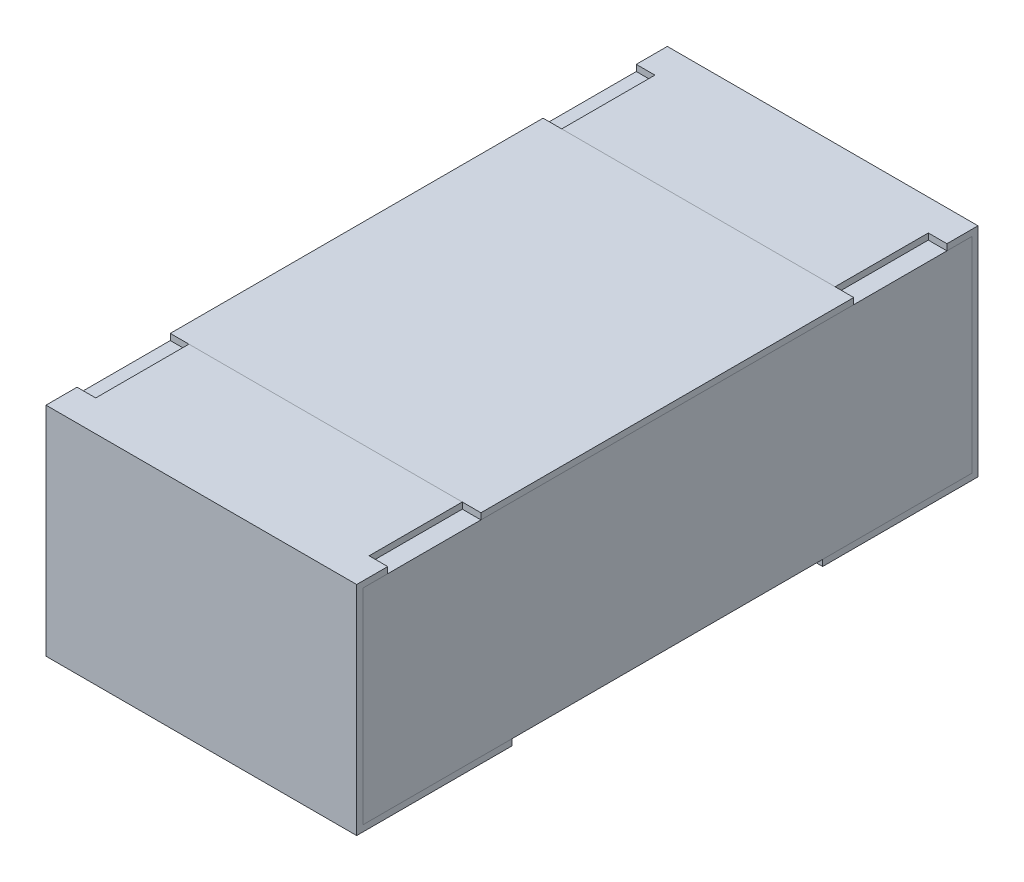
ISO-10303-21;
HEADER;
FILE_DESCRIPTION(('STEP AP214'),'2;1');
FILE_NAME('part.step','',(''),(''),'','','');
FILE_SCHEMA(('AUTOMOTIVE_DESIGN { 1 0 10303 214 1 1 1 1 }'));
ENDSEC;
DATA;
#1=APPLICATION_CONTEXT('core data for automotive mechanical design processes');
#2=APPLICATION_PROTOCOL_DEFINITION('international standard','automotive_design',2000,#1);
#3=PRODUCT_CONTEXT('',#1,'mechanical');
#4=PRODUCT('Part','Part','',(#3));
#5=PRODUCT_RELATED_PRODUCT_CATEGORY('part','',(#4));
#6=PRODUCT_DEFINITION_FORMATION('','',#4);
#7=PRODUCT_DEFINITION_CONTEXT('part definition',#1,'design');
#8=PRODUCT_DEFINITION('design','',#6,#7);
#9=PRODUCT_DEFINITION_SHAPE('','',#8);
#10=(LENGTH_UNIT() NAMED_UNIT(*) SI_UNIT(.MILLI.,.METRE.));
#11=(NAMED_UNIT(*) PLANE_ANGLE_UNIT() SI_UNIT($,.RADIAN.));
#12=(NAMED_UNIT(*) SI_UNIT($,.STERADIAN.) SOLID_ANGLE_UNIT());
#13=UNCERTAINTY_MEASURE_WITH_UNIT(LENGTH_MEASURE(1.E-05),#10,'distance_accuracy_value','');
#14=(GEOMETRIC_REPRESENTATION_CONTEXT(3) GLOBAL_UNCERTAINTY_ASSIGNED_CONTEXT((#13)) GLOBAL_UNIT_ASSIGNED_CONTEXT((#10,
#11,#12)) REPRESENTATION_CONTEXT('',''));
#15=CARTESIAN_POINT('',(0.,0.,0.));
#16=DIRECTION('',(0.,0.,1.));
#17=DIRECTION('',(1.,0.,0.));
#18=AXIS2_PLACEMENT_3D('',#15,#16,#17);
#19=CARTESIAN_POINT('',(-0.25,0.165,0.3));
#20=DIRECTION('',(0.,1.,0.));
#21=DIRECTION('',(0.,0.,1.));
#22=AXIS2_PLACEMENT_3D('',#19,#20,#21);
#23=PLANE('',#22);
#24=DIRECTION('',(0.,0.,1.));
#25=VECTOR('',#24,1.);
#26=CARTESIAN_POINT('',(-0.25,0.165,-0.3));
#27=LINE('',#26,#25);
#28=CARTESIAN_POINT('',(-0.25,0.165,-0.3));
#29=VERTEX_POINT('',#28);
#30=CARTESIAN_POINT('',(-0.25,0.165,0.3));
#31=VERTEX_POINT('',#30);
#32=EDGE_CURVE('E95',#29,#31,#27,.T.);
#33=ORIENTED_EDGE('',*,*,#32,.F.);
#34=DIRECTION('',(-1.,0.,0.));
#35=VECTOR('',#34,1.);
#36=CARTESIAN_POINT('',(-0.25,0.165,-0.3));
#37=LINE('',#36,#35);
#38=CARTESIAN_POINT('',(0.25,0.165,-0.3));
#39=VERTEX_POINT('',#38);
#40=EDGE_CURVE('E106',#39,#29,#37,.T.);
#41=ORIENTED_EDGE('',*,*,#40,.F.);
#42=DIRECTION('',(0.,0.,-1.));
#43=VECTOR('',#42,1.);
#44=CARTESIAN_POINT('',(0.25,0.165,-0.3));
#45=LINE('',#44,#43);
#46=CARTESIAN_POINT('',(0.250000000000001,0.165,0.3));
#47=VERTEX_POINT('',#46);
#48=EDGE_CURVE('E97',#47,#39,#45,.T.);
#49=ORIENTED_EDGE('',*,*,#48,.F.);
#50=DIRECTION('',(1.,0.,0.));
#51=VECTOR('',#50,1.);
#52=CARTESIAN_POINT('',(-0.25,0.165,0.3));
#53=LINE('',#52,#51);
#54=EDGE_CURVE('E87',#31,#47,#53,.T.);
#55=ORIENTED_EDGE('',*,*,#54,.F.);
#56=EDGE_LOOP('',(#33,#41,#49,#55));
#57=FACE_BOUND('',#56,.T.);
#58=ADVANCED_FACE('F45',(#57),#23,.F.);
#59=CARTESIAN_POINT('',(-0.25,0.956024967590666,-0.3));
#60=DIRECTION('',(0.,0.,1.));
#61=DIRECTION('',(1.,0.,0.));
#62=AXIS2_PLACEMENT_3D('',#59,#60,#61);
#63=PLANE('',#62);
#64=DIRECTION('',(0.,-1.,0.));
#65=VECTOR('',#64,1.);
#66=CARTESIAN_POINT('',(-0.25,0.956024967590666,-0.3));
#67=LINE('',#66,#65);
#68=CARTESIAN_POINT('',(-0.25,0.175,-0.3));
#69=VERTEX_POINT('',#68);
#70=EDGE_CURVE('E100',#69,#29,#67,.T.);
#71=ORIENTED_EDGE('',*,*,#70,.F.);
#72=DIRECTION('',(1.,0.,0.));
#73=VECTOR('',#72,1.);
#74=CARTESIAN_POINT('',(-0.25,0.175,-0.3));
#75=LINE('',#74,#73);
#76=CARTESIAN_POINT('',(0.25,0.175,-0.3));
#77=VERTEX_POINT('',#76);
#78=EDGE_CURVE('E49',#69,#77,#75,.T.);
#79=ORIENTED_EDGE('',*,*,#78,.T.);
#80=DIRECTION('',(0.,-1.,0.));
#81=VECTOR('',#80,1.);
#82=CARTESIAN_POINT('',(0.25,0.956024967590666,-0.3));
#83=LINE('',#82,#81);
#84=EDGE_CURVE('E109',#77,#39,#83,.T.);
#85=ORIENTED_EDGE('',*,*,#84,.T.);
#86=ORIENTED_EDGE('',*,*,#40,.T.);
#87=EDGE_LOOP('',(#71,#79,#85,#86));
#88=FACE_BOUND('',#87,.T.);
#89=ADVANCED_FACE('F118',(#88),#63,.F.);
#90=CARTESIAN_POINT('',(0.25,0.956024967590666,-0.3));
#91=DIRECTION('',(-1.,0.,0.));
#92=DIRECTION('',(0.,0.,1.));
#93=AXIS2_PLACEMENT_3D('',#90,#91,#92);
#94=PLANE('',#93);
#95=ORIENTED_EDGE('',*,*,#84,.F.);
#96=DIRECTION('',(0.,0.,1.));
#97=VECTOR('',#96,1.);
#98=CARTESIAN_POINT('',(0.25,0.175,-0.3));
#99=LINE('',#98,#97);
#100=CARTESIAN_POINT('',(0.250000000000001,0.175,0.3));
#101=VERTEX_POINT('',#100);
#102=EDGE_CURVE('E115',#77,#101,#99,.T.);
#103=ORIENTED_EDGE('',*,*,#102,.T.);
#104=DIRECTION('',(0.,-1.,0.));
#105=VECTOR('',#104,1.);
#106=CARTESIAN_POINT('',(0.250000000000001,0.956024967590666,0.3));
#107=LINE('',#106,#105);
#108=EDGE_CURVE('E91',#101,#47,#107,.T.);
#109=ORIENTED_EDGE('',*,*,#108,.T.);
#110=ORIENTED_EDGE('',*,*,#48,.T.);
#111=EDGE_LOOP('',(#95,#103,#109,#110));
#112=FACE_BOUND('',#111,.T.);
#113=ADVANCED_FACE('F114',(#112),#94,.F.);
#114=CARTESIAN_POINT('',(-0.25,0.956024967590666,0.3));
#115=DIRECTION('',(0.,0.,-1.));
#116=DIRECTION('',(-1.,0.,0.));
#117=AXIS2_PLACEMENT_3D('',#114,#115,#116);
#118=PLANE('',#117);
#119=ORIENTED_EDGE('',*,*,#108,.F.);
#120=DIRECTION('',(-1.,0.,0.));
#121=VECTOR('',#120,1.);
#122=CARTESIAN_POINT('',(-0.25,0.175,0.3));
#123=LINE('',#122,#121);
#124=CARTESIAN_POINT('',(-0.25,0.175,0.3));
#125=VERTEX_POINT('',#124);
#126=EDGE_CURVE('E54',#101,#125,#123,.T.);
#127=ORIENTED_EDGE('',*,*,#126,.T.);
#128=DIRECTION('',(0.,-1.,0.));
#129=VECTOR('',#128,1.);
#130=CARTESIAN_POINT('',(-0.25,0.956024967590666,0.3));
#131=LINE('',#130,#129);
#132=EDGE_CURVE('E84',#125,#31,#131,.T.);
#133=ORIENTED_EDGE('',*,*,#132,.T.);
#134=ORIENTED_EDGE('',*,*,#54,.T.);
#135=EDGE_LOOP('',(#119,#127,#133,#134));
#136=FACE_BOUND('',#135,.T.);
#137=ADVANCED_FACE('F86',(#136),#118,.F.);
#138=CARTESIAN_POINT('',(-0.25,0.956024967590666,-0.3));
#139=DIRECTION('',(1.,0.,0.));
#140=DIRECTION('',(0.,0.,-1.));
#141=AXIS2_PLACEMENT_3D('',#138,#139,#140);
#142=PLANE('',#141);
#143=ORIENTED_EDGE('',*,*,#132,.F.);
#144=DIRECTION('',(0.,0.,-1.));
#145=VECTOR('',#144,1.);
#146=CARTESIAN_POINT('',(-0.25,0.175,-0.3));
#147=LINE('',#146,#145);
#148=EDGE_CURVE('E12',#125,#69,#147,.T.);
#149=ORIENTED_EDGE('',*,*,#148,.T.);
#150=ORIENTED_EDGE('',*,*,#70,.T.);
#151=ORIENTED_EDGE('',*,*,#32,.T.);
#152=EDGE_LOOP('',(#143,#149,#150,#151));
#153=FACE_BOUND('',#152,.T.);
#154=ADVANCED_FACE('F47',(#153),#142,.F.);
#155=CARTESIAN_POINT('',(0.25,0.175,-0.3));
#156=DIRECTION('',(0.,-1.,0.));
#157=DIRECTION('',(0.,0.,-1.));
#158=AXIS2_PLACEMENT_3D('',#155,#156,#157);
#159=PLANE('',#158);
#160=ORIENTED_EDGE('',*,*,#126,.F.);
#161=ORIENTED_EDGE('',*,*,#102,.F.);
#162=ORIENTED_EDGE('',*,*,#78,.F.);
#163=ORIENTED_EDGE('',*,*,#148,.F.);
#164=EDGE_LOOP('',(#160,#161,#162,#163));
#165=FACE_BOUND('',#164,.T.);
#166=ADVANCED_FACE('F132',(#165),#159,.F.);
#167=CLOSED_SHELL('',(#58,#89,#113,#137,#154,#166));
#168=MANIFOLD_SOLID_BREP('B2',#167);
#169=CARTESIAN_POINT('',(1.2840696301507,0.165,0.49));
#170=DIRECTION('',(0.,0.,-1.));
#171=DIRECTION('',(-1.,0.,0.));
#172=AXIS2_PLACEMENT_3D('',#169,#170,#171);
#173=PLANE('',#172);
#174=DIRECTION('',(0.,-1.,0.));
#175=VECTOR('',#174,1.);
#176=CARTESIAN_POINT('',(0.25,0.165,0.49));
#177=LINE('',#176,#175);
#178=CARTESIAN_POINT('',(0.25,0.165,0.49));
#179=VERTEX_POINT('',#178);
#180=CARTESIAN_POINT('',(0.25,-0.165,0.49));
#181=VERTEX_POINT('',#180);
#182=EDGE_CURVE('E244',#179,#181,#177,.T.);
#183=ORIENTED_EDGE('',*,*,#182,.F.);
#184=DIRECTION('',(-1.,0.,0.));
#185=VECTOR('',#184,1.);
#186=CARTESIAN_POINT('',(1.2840696301507,0.165,0.49));
#187=LINE('',#186,#185);
#188=CARTESIAN_POINT('',(-0.25,0.165,0.49));
#189=VERTEX_POINT('',#188);
#190=EDGE_CURVE('E182',#179,#189,#187,.T.);
#191=ORIENTED_EDGE('',*,*,#190,.T.);
#192=DIRECTION('',(0.,1.,0.));
#193=VECTOR('',#192,1.);
#194=CARTESIAN_POINT('',(-0.25,0.165,0.49));
#195=LINE('',#194,#193);
#196=CARTESIAN_POINT('',(-0.25,-0.165,0.49));
#197=VERTEX_POINT('',#196);
#198=EDGE_CURVE('E238',#197,#189,#195,.T.);
#199=ORIENTED_EDGE('',*,*,#198,.F.);
#200=DIRECTION('',(-1.,0.,0.));
#201=VECTOR('',#200,1.);
#202=CARTESIAN_POINT('',(1.2840696301507,-0.165,0.49));
#203=LINE('',#202,#201);
#204=EDGE_CURVE('E227',#181,#197,#203,.T.);
#205=ORIENTED_EDGE('',*,*,#204,.F.);
#206=EDGE_LOOP('',(#183,#191,#199,#205));
#207=FACE_BOUND('',#206,.T.);
#208=ADVANCED_FACE('F178',(#207),#173,.F.);
#209=CARTESIAN_POINT('',(1.2840696301507,-0.165,0.49));
#210=DIRECTION('',(0.,1.,0.));
#211=DIRECTION('',(0.,0.,1.));
#212=AXIS2_PLACEMENT_3D('',#209,#210,#211);
#213=PLANE('',#212);
#214=DIRECTION('',(0.,0.,-1.));
#215=VECTOR('',#214,1.);
#216=CARTESIAN_POINT('',(0.25,-0.165,0.49));
#217=LINE('',#216,#215);
#218=CARTESIAN_POINT('',(0.25,-0.165,-0.49));
#219=VERTEX_POINT('',#218);
#220=EDGE_CURVE('E187',#181,#219,#217,.T.);
#221=ORIENTED_EDGE('',*,*,#220,.F.);
#222=ORIENTED_EDGE('',*,*,#204,.T.);
#223=DIRECTION('',(0.,0.,1.));
#224=VECTOR('',#223,1.);
#225=CARTESIAN_POINT('',(-0.25,-0.165,0.49));
#226=LINE('',#225,#224);
#227=CARTESIAN_POINT('',(-0.25,-0.165,-0.49));
#228=VERTEX_POINT('',#227);
#229=EDGE_CURVE('E233',#228,#197,#226,.T.);
#230=ORIENTED_EDGE('',*,*,#229,.F.);
#231=DIRECTION('',(-1.,0.,0.));
#232=VECTOR('',#231,1.);
#233=CARTESIAN_POINT('',(1.2840696301507,-0.165,-0.49));
#234=LINE('',#233,#232);
#235=EDGE_CURVE('E222',#219,#228,#234,.T.);
#236=ORIENTED_EDGE('',*,*,#235,.F.);
#237=EDGE_LOOP('',(#221,#222,#230,#236));
#238=FACE_BOUND('',#237,.T.);
#239=ADVANCED_FACE('F237',(#238),#213,.F.);
#240=CARTESIAN_POINT('',(1.2840696301507,0.165,-0.49));
#241=DIRECTION('',(0.,0.,1.));
#242=DIRECTION('',(1.,0.,0.));
#243=AXIS2_PLACEMENT_3D('',#240,#241,#242);
#244=PLANE('',#243);
#245=DIRECTION('',(0.,1.,0.));
#246=VECTOR('',#245,1.);
#247=CARTESIAN_POINT('',(0.25,0.165,-0.49));
#248=LINE('',#247,#246);
#249=CARTESIAN_POINT('',(0.25,0.165,-0.49));
#250=VERTEX_POINT('',#249);
#251=EDGE_CURVE('E43',#219,#250,#248,.T.);
#252=ORIENTED_EDGE('',*,*,#251,.F.);
#253=ORIENTED_EDGE('',*,*,#235,.T.);
#254=DIRECTION('',(0.,-1.,0.));
#255=VECTOR('',#254,1.);
#256=CARTESIAN_POINT('',(-0.25,0.165,-0.49));
#257=LINE('',#256,#255);
#258=CARTESIAN_POINT('',(-0.25,0.165,-0.49));
#259=VERTEX_POINT('',#258);
#260=EDGE_CURVE('E225',#259,#228,#257,.T.);
#261=ORIENTED_EDGE('',*,*,#260,.F.);
#262=DIRECTION('',(-1.,0.,0.));
#263=VECTOR('',#262,1.);
#264=CARTESIAN_POINT('',(1.2840696301507,0.165,-0.49));
#265=LINE('',#264,#263);
#266=EDGE_CURVE('E203',#250,#259,#265,.T.);
#267=ORIENTED_EDGE('',*,*,#266,.F.);
#268=EDGE_LOOP('',(#252,#253,#261,#267));
#269=FACE_BOUND('',#268,.T.);
#270=ADVANCED_FACE('F224',(#269),#244,.F.);
#271=CARTESIAN_POINT('',(1.2840696301507,0.165,0.49));
#272=DIRECTION('',(0.,-1.,0.));
#273=DIRECTION('',(0.,0.,-1.));
#274=AXIS2_PLACEMENT_3D('',#271,#272,#273);
#275=PLANE('',#274);
#276=DIRECTION('',(0.,0.,1.));
#277=VECTOR('',#276,1.);
#278=CARTESIAN_POINT('',(0.25,0.165,0.49));
#279=LINE('',#278,#277);
#280=EDGE_CURVE('E247',#250,#179,#279,.T.);
#281=ORIENTED_EDGE('',*,*,#280,.F.);
#282=ORIENTED_EDGE('',*,*,#266,.T.);
#283=DIRECTION('',(0.,0.,-1.));
#284=VECTOR('',#283,1.);
#285=CARTESIAN_POINT('',(-0.25,0.165,0.49));
#286=LINE('',#285,#284);
#287=EDGE_CURVE('E235',#189,#259,#286,.T.);
#288=ORIENTED_EDGE('',*,*,#287,.F.);
#289=ORIENTED_EDGE('',*,*,#190,.F.);
#290=EDGE_LOOP('',(#281,#282,#288,#289));
#291=FACE_BOUND('',#290,.T.);
#292=ADVANCED_FACE('F251',(#291),#275,.F.);
#293=CARTESIAN_POINT('',(0.25,0.175,0.5));
#294=DIRECTION('',(1.,0.,0.));
#295=DIRECTION('',(0.,0.,-1.));
#296=AXIS2_PLACEMENT_3D('',#293,#294,#295);
#297=PLANE('',#296);
#298=ORIENTED_EDGE('',*,*,#280,.T.);
#299=ORIENTED_EDGE('',*,*,#182,.T.);
#300=ORIENTED_EDGE('',*,*,#220,.T.);
#301=ORIENTED_EDGE('',*,*,#251,.T.);
#302=EDGE_LOOP('',(#298,#299,#300,#301));
#303=FACE_BOUND('',#302,.T.);
#304=ADVANCED_FACE('F180',(#303),#297,.T.);
#305=CARTESIAN_POINT('',(-0.25,0.175,0.5));
#306=DIRECTION('',(1.,0.,0.));
#307=DIRECTION('',(0.,0.,-1.));
#308=AXIS2_PLACEMENT_3D('',#305,#306,#307);
#309=PLANE('',#308);
#310=ORIENTED_EDGE('',*,*,#198,.T.);
#311=ORIENTED_EDGE('',*,*,#287,.T.);
#312=ORIENTED_EDGE('',*,*,#260,.T.);
#313=ORIENTED_EDGE('',*,*,#229,.T.);
#314=EDGE_LOOP('',(#310,#311,#312,#313));
#315=FACE_BOUND('',#314,.T.);
#316=ADVANCED_FACE('F232',(#315),#309,.F.);
#317=CLOSED_SHELL('',(#208,#239,#270,#292,#304,#316));
#318=MANIFOLD_SOLID_BREP('B6',#317);
#319=CARTESIAN_POINT('',(0.25,0.175,-0.3));
#320=DIRECTION('',(0.,0.,-1.));
#321=DIRECTION('',(-1.,0.,0.));
#322=AXIS2_PLACEMENT_3D('',#319,#320,#321);
#323=PLANE('',#322);
#324=DIRECTION('',(-1.,0.,0.));
#325=VECTOR('',#324,1.);
#326=CARTESIAN_POINT('',(0.25,0.175,-0.3));
#327=LINE('',#326,#325);
#328=CARTESIAN_POINT('',(0.22,0.175,-0.3));
#329=VERTEX_POINT('',#328);
#330=CARTESIAN_POINT('',(-0.22,0.175,-0.3));
#331=VERTEX_POINT('',#330);
#332=EDGE_CURVE('E414',#329,#331,#327,.T.);
#333=ORIENTED_EDGE('',*,*,#332,.T.);
#334=DIRECTION('',(0.,1.,0.));
#335=VECTOR('',#334,1.);
#336=CARTESIAN_POINT('',(-0.22,0.0120294145922162,-0.3));
#337=LINE('',#336,#335);
#338=CARTESIAN_POINT('',(-0.22,0.165,-0.3));
#339=VERTEX_POINT('',#338);
#340=EDGE_CURVE('E403',#339,#331,#337,.T.);
#341=ORIENTED_EDGE('',*,*,#340,.F.);
#342=DIRECTION('',(-1.,0.,0.));
#343=VECTOR('',#342,1.);
#344=CARTESIAN_POINT('',(0.25,0.165,-0.3));
#345=LINE('',#344,#343);
#346=CARTESIAN_POINT('',(0.22,0.165,-0.3));
#347=VERTEX_POINT('',#346);
#348=EDGE_CURVE('E176',#347,#339,#345,.T.);
#349=ORIENTED_EDGE('',*,*,#348,.F.);
#350=DIRECTION('',(0.,1.,0.));
#351=VECTOR('',#350,1.);
#352=CARTESIAN_POINT('',(0.22,0.0120294145922162,-0.3));
#353=LINE('',#352,#351);
#354=EDGE_CURVE('E421',#347,#329,#353,.T.);
#355=ORIENTED_EDGE('',*,*,#354,.T.);
#356=EDGE_LOOP('',(#333,#341,#349,#355));
#357=FACE_BOUND('',#356,.T.);
#358=ADVANCED_FACE('F310',(#357),#323,.F.);
#359=CARTESIAN_POINT('',(0.25,0.165,-0.3));
#360=DIRECTION('',(0.,1.,0.));
#361=DIRECTION('',(0.,0.,1.));
#362=AXIS2_PLACEMENT_3D('',#359,#360,#361);
#363=PLANE('',#362);
#364=ORIENTED_EDGE('',*,*,#348,.T.);
#365=DIRECTION('',(0.,0.,-1.));
#366=VECTOR('',#365,1.);
#367=CARTESIAN_POINT('',(-0.22,0.165,-0.45));
#368=LINE('',#367,#366);
#369=CARTESIAN_POINT('',(-0.22,0.165,-0.45));
#370=VERTEX_POINT('',#369);
#371=EDGE_CURVE('E399',#339,#370,#368,.T.);
#372=ORIENTED_EDGE('',*,*,#371,.T.);
#373=DIRECTION('',(-1.,0.,0.));
#374=VECTOR('',#373,1.);
#375=CARTESIAN_POINT('',(-0.25,0.165,-0.45));
#376=LINE('',#375,#374);
#377=CARTESIAN_POINT('',(-0.25,0.165,-0.45));
#378=VERTEX_POINT('',#377);
#379=EDGE_CURVE('E641',#370,#378,#376,.T.);
#380=ORIENTED_EDGE('',*,*,#379,.T.);
#381=DIRECTION('',(0.,0.,-1.));
#382=VECTOR('',#381,1.);
#383=CARTESIAN_POINT('',(-0.25,0.165,-0.3));
#384=LINE('',#383,#382);
#385=CARTESIAN_POINT('',(-0.25,0.165,-0.49));
#386=VERTEX_POINT('',#385);
#387=EDGE_CURVE('E451',#378,#386,#384,.T.);
#388=ORIENTED_EDGE('',*,*,#387,.T.);
#389=DIRECTION('',(-1.,0.,0.));
#390=VECTOR('',#389,1.);
#391=CARTESIAN_POINT('',(0.25,0.165,-0.49));
#392=LINE('',#391,#390);
#393=CARTESIAN_POINT('',(0.25,0.165,-0.49));
#394=VERTEX_POINT('',#393);
#395=EDGE_CURVE('E317',#394,#386,#392,.T.);
#396=ORIENTED_EDGE('',*,*,#395,.F.);
#397=DIRECTION('',(0.,0.,-1.));
#398=VECTOR('',#397,1.);
#399=CARTESIAN_POINT('',(0.25,0.165,-0.3));
#400=LINE('',#399,#398);
#401=CARTESIAN_POINT('',(0.25,0.165,-0.45));
#402=VERTEX_POINT('',#401);
#403=EDGE_CURVE('E435',#402,#394,#400,.T.);
#404=ORIENTED_EDGE('',*,*,#403,.F.);
#405=DIRECTION('',(-1.,0.,0.));
#406=VECTOR('',#405,1.);
#407=CARTESIAN_POINT('',(0.25,0.165,-0.45));
#408=LINE('',#407,#406);
#409=CARTESIAN_POINT('',(0.22,0.165,-0.45));
#410=VERTEX_POINT('',#409);
#411=EDGE_CURVE('E324',#402,#410,#408,.T.);
#412=ORIENTED_EDGE('',*,*,#411,.T.);
#413=DIRECTION('',(0.,0.,1.));
#414=VECTOR('',#413,1.);
#415=CARTESIAN_POINT('',(0.22,0.165,-0.45));
#416=LINE('',#415,#414);
#417=EDGE_CURVE('E418',#410,#347,#416,.T.);
#418=ORIENTED_EDGE('',*,*,#417,.T.);
#419=EDGE_LOOP('',(#364,#372,#380,#388,#396,#404,#412,#418));
#420=FACE_BOUND('',#419,.T.);
#421=ADVANCED_FACE('F417',(#420),#363,.F.);
#422=CARTESIAN_POINT('',(0.25,0.165,-0.49));
#423=DIRECTION('',(0.,0.,-1.));
#424=DIRECTION('',(-1.,0.,0.));
#425=AXIS2_PLACEMENT_3D('',#422,#423,#424);
#426=PLANE('',#425);
#427=DIRECTION('',(0.,-1.,0.));
#428=VECTOR('',#427,1.);
#429=CARTESIAN_POINT('',(-0.25,0.165,-0.49));
#430=LINE('',#429,#428);
#431=CARTESIAN_POINT('',(-0.25,-0.165,-0.49));
#432=VERTEX_POINT('',#431);
#433=EDGE_CURVE('E453',#386,#432,#430,.T.);
#434=ORIENTED_EDGE('',*,*,#433,.T.);
#435=DIRECTION('',(-1.,0.,0.));
#436=VECTOR('',#435,1.);
#437=CARTESIAN_POINT('',(0.25,-0.165,-0.49));
#438=LINE('',#437,#436);
#439=CARTESIAN_POINT('',(0.25,-0.165,-0.49));
#440=VERTEX_POINT('',#439);
#441=EDGE_CURVE('E479',#440,#432,#438,.T.);
#442=ORIENTED_EDGE('',*,*,#441,.F.);
#443=DIRECTION('',(0.,-1.,0.));
#444=VECTOR('',#443,1.);
#445=CARTESIAN_POINT('',(0.25,0.165,-0.49));
#446=LINE('',#445,#444);
#447=EDGE_CURVE('E437',#394,#440,#446,.T.);
#448=ORIENTED_EDGE('',*,*,#447,.F.);
#449=ORIENTED_EDGE('',*,*,#395,.T.);
#450=EDGE_LOOP('',(#434,#442,#448,#449));
#451=FACE_BOUND('',#450,.T.);
#452=ADVANCED_FACE('F486',(#451),#426,.F.);
#453=CARTESIAN_POINT('',(0.25,-0.165,-0.49));
#454=DIRECTION('',(0.,-1.,0.));
#455=DIRECTION('',(0.,0.,-1.));
#456=AXIS2_PLACEMENT_3D('',#453,#454,#455);
#457=PLANE('',#456);
#458=DIRECTION('',(0.,0.,1.));
#459=VECTOR('',#458,1.);
#460=CARTESIAN_POINT('',(-0.25,-0.165,-0.49));
#461=LINE('',#460,#459);
#462=CARTESIAN_POINT('',(-0.25,-0.165,-0.25));
#463=VERTEX_POINT('',#462);
#464=EDGE_CURVE('E456',#432,#463,#461,.T.);
#465=ORIENTED_EDGE('',*,*,#464,.T.);
#466=DIRECTION('',(-1.,0.,0.));
#467=VECTOR('',#466,1.);
#468=CARTESIAN_POINT('',(0.25,-0.165,-0.25));
#469=LINE('',#468,#467);
#470=CARTESIAN_POINT('',(0.25,-0.165,-0.25));
#471=VERTEX_POINT('',#470);
#472=EDGE_CURVE('E476',#471,#463,#469,.T.);
#473=ORIENTED_EDGE('',*,*,#472,.F.);
#474=DIRECTION('',(0.,0.,1.));
#475=VECTOR('',#474,1.);
#476=CARTESIAN_POINT('',(0.25,-0.165,-0.49));
#477=LINE('',#476,#475);
#478=EDGE_CURVE('E440',#440,#471,#477,.T.);
#479=ORIENTED_EDGE('',*,*,#478,.F.);
#480=ORIENTED_EDGE('',*,*,#441,.T.);
#481=EDGE_LOOP('',(#465,#473,#479,#480));
#482=FACE_BOUND('',#481,.T.);
#483=ADVANCED_FACE('F496',(#482),#457,.F.);
#484=CARTESIAN_POINT('',(0.25,-0.165,-0.25));
#485=DIRECTION('',(0.,0.,-1.));
#486=DIRECTION('',(-1.,0.,0.));
#487=AXIS2_PLACEMENT_3D('',#484,#485,#486);
#488=PLANE('',#487);
#489=DIRECTION('',(0.,-1.,0.));
#490=VECTOR('',#489,1.);
#491=CARTESIAN_POINT('',(-0.25,-0.165,-0.25));
#492=LINE('',#491,#490);
#493=CARTESIAN_POINT('',(-0.25,-0.175,-0.25));
#494=VERTEX_POINT('',#493);
#495=EDGE_CURVE('E458',#463,#494,#492,.T.);
#496=ORIENTED_EDGE('',*,*,#495,.T.);
#497=DIRECTION('',(-1.,0.,0.));
#498=VECTOR('',#497,1.);
#499=CARTESIAN_POINT('',(0.25,-0.175,-0.25));
#500=LINE('',#499,#498);
#501=CARTESIAN_POINT('',(0.25,-0.175,-0.25));
#502=VERTEX_POINT('',#501);
#503=EDGE_CURVE('E473',#502,#494,#500,.T.);
#504=ORIENTED_EDGE('',*,*,#503,.F.);
#505=DIRECTION('',(0.,-1.,0.));
#506=VECTOR('',#505,1.);
#507=CARTESIAN_POINT('',(0.25,-0.165,-0.25));
#508=LINE('',#507,#506);
#509=EDGE_CURVE('E442',#471,#502,#508,.T.);
#510=ORIENTED_EDGE('',*,*,#509,.F.);
#511=ORIENTED_EDGE('',*,*,#472,.T.);
#512=EDGE_LOOP('',(#496,#504,#510,#511));
#513=FACE_BOUND('',#512,.T.);
#514=ADVANCED_FACE('F500',(#513),#488,.F.);
#515=CARTESIAN_POINT('',(0.25,-0.175,-0.5));
#516=DIRECTION('',(0.,1.,0.));
#517=DIRECTION('',(0.,0.,1.));
#518=AXIS2_PLACEMENT_3D('',#515,#516,#517);
#519=PLANE('',#518);
#520=DIRECTION('',(0.,0.,-1.));
#521=VECTOR('',#520,1.);
#522=CARTESIAN_POINT('',(-0.25,-0.175,-0.5));
#523=LINE('',#522,#521);
#524=CARTESIAN_POINT('',(-0.25,-0.175,-0.5));
#525=VERTEX_POINT('',#524);
#526=EDGE_CURVE('E460',#494,#525,#523,.T.);
#527=ORIENTED_EDGE('',*,*,#526,.T.);
#528=DIRECTION('',(-1.,0.,0.));
#529=VECTOR('',#528,1.);
#530=CARTESIAN_POINT('',(0.25,-0.175,-0.5));
#531=LINE('',#530,#529);
#532=CARTESIAN_POINT('',(0.25,-0.175,-0.5));
#533=VERTEX_POINT('',#532);
#534=EDGE_CURVE('E470',#533,#525,#531,.T.);
#535=ORIENTED_EDGE('',*,*,#534,.F.);
#536=DIRECTION('',(0.,0.,-1.));
#537=VECTOR('',#536,1.);
#538=CARTESIAN_POINT('',(0.25,-0.175,-0.5));
#539=LINE('',#538,#537);
#540=EDGE_CURVE('E444',#502,#533,#539,.T.);
#541=ORIENTED_EDGE('',*,*,#540,.F.);
#542=ORIENTED_EDGE('',*,*,#503,.T.);
#543=EDGE_LOOP('',(#527,#535,#541,#542));
#544=FACE_BOUND('',#543,.T.);
#545=ADVANCED_FACE('F537',(#544),#519,.F.);
#546=CARTESIAN_POINT('',(0.25,0.175,-0.5));
#547=DIRECTION('',(0.,0.,1.));
#548=DIRECTION('',(1.,0.,0.));
#549=AXIS2_PLACEMENT_3D('',#546,#547,#548);
#550=PLANE('',#549);
#551=DIRECTION('',(0.,1.,0.));
#552=VECTOR('',#551,1.);
#553=CARTESIAN_POINT('',(-0.25,0.175,-0.5));
#554=LINE('',#553,#552);
#555=CARTESIAN_POINT('',(-0.25,0.175,-0.5));
#556=VERTEX_POINT('',#555);
#557=EDGE_CURVE('E462',#525,#556,#554,.T.);
#558=ORIENTED_EDGE('',*,*,#557,.T.);
#559=DIRECTION('',(-1.,0.,0.));
#560=VECTOR('',#559,1.);
#561=CARTESIAN_POINT('',(0.25,0.175,-0.5));
#562=LINE('',#561,#560);
#563=CARTESIAN_POINT('',(0.25,0.175,-0.5));
#564=VERTEX_POINT('',#563);
#565=EDGE_CURVE('E467',#564,#556,#562,.T.);
#566=ORIENTED_EDGE('',*,*,#565,.F.);
#567=DIRECTION('',(0.,1.,0.));
#568=VECTOR('',#567,1.);
#569=CARTESIAN_POINT('',(0.25,0.175,-0.5));
#570=LINE('',#569,#568);
#571=EDGE_CURVE('E446',#533,#564,#570,.T.);
#572=ORIENTED_EDGE('',*,*,#571,.F.);
#573=ORIENTED_EDGE('',*,*,#534,.T.);
#574=EDGE_LOOP('',(#558,#566,#572,#573));
#575=FACE_BOUND('',#574,.T.);
#576=ADVANCED_FACE('F540',(#575),#550,.F.);
#577=CARTESIAN_POINT('',(0.25,0.175,-0.3));
#578=DIRECTION('',(0.,-1.,0.));
#579=DIRECTION('',(0.,0.,-1.));
#580=AXIS2_PLACEMENT_3D('',#577,#578,#579);
#581=PLANE('',#580);
#582=DIRECTION('',(-1.,0.,0.));
#583=VECTOR('',#582,1.);
#584=CARTESIAN_POINT('',(-0.25,0.175,-0.45));
#585=LINE('',#584,#583);
#586=CARTESIAN_POINT('',(-0.22,0.175,-0.45));
#587=VERTEX_POINT('',#586);
#588=CARTESIAN_POINT('',(-0.25,0.175,-0.45));
#589=VERTEX_POINT('',#588);
#590=EDGE_CURVE('E332',#587,#589,#585,.T.);
#591=ORIENTED_EDGE('',*,*,#590,.F.);
#592=DIRECTION('',(0.,0.,-1.));
#593=VECTOR('',#592,1.);
#594=CARTESIAN_POINT('',(-0.22,0.175,-0.45));
#595=LINE('',#594,#593);
#596=EDGE_CURVE('E434',#331,#587,#595,.T.);
#597=ORIENTED_EDGE('',*,*,#596,.F.);
#598=ORIENTED_EDGE('',*,*,#332,.F.);
#599=DIRECTION('',(0.,0.,1.));
#600=VECTOR('',#599,1.);
#601=CARTESIAN_POINT('',(0.22,0.175,-0.45));
#602=LINE('',#601,#600);
#603=CARTESIAN_POINT('',(0.22,0.175,-0.45));
#604=VERTEX_POINT('',#603);
#605=EDGE_CURVE('E422',#604,#329,#602,.T.);
#606=ORIENTED_EDGE('',*,*,#605,.F.);
#607=DIRECTION('',(-1.,0.,0.));
#608=VECTOR('',#607,1.);
#609=CARTESIAN_POINT('',(0.25,0.175,-0.45));
#610=LINE('',#609,#608);
#611=CARTESIAN_POINT('',(0.25,0.175,-0.45));
#612=VERTEX_POINT('',#611);
#613=EDGE_CURVE('E426',#612,#604,#610,.T.);
#614=ORIENTED_EDGE('',*,*,#613,.F.);
#615=DIRECTION('',(0.,0.,1.));
#616=VECTOR('',#615,1.);
#617=CARTESIAN_POINT('',(0.25,0.175,-0.3));
#618=LINE('',#617,#616);
#619=EDGE_CURVE('E448',#564,#612,#618,.T.);
#620=ORIENTED_EDGE('',*,*,#619,.F.);
#621=ORIENTED_EDGE('',*,*,#565,.T.);
#622=DIRECTION('',(0.,0.,1.));
#623=VECTOR('',#622,1.);
#624=CARTESIAN_POINT('',(-0.25,0.175,-0.3));
#625=LINE('',#624,#623);
#626=EDGE_CURVE('E438',#556,#589,#625,.T.);
#627=ORIENTED_EDGE('',*,*,#626,.T.);
#628=EDGE_LOOP('',(#591,#597,#598,#606,#614,#620,#621,#627));
#629=FACE_BOUND('',#628,.T.);
#630=ADVANCED_FACE('F512',(#629),#581,.F.);
#631=CARTESIAN_POINT('',(0.25,0.165,-0.3));
#632=DIRECTION('',(1.,0.,0.));
#633=DIRECTION('',(0.,0.,-1.));
#634=AXIS2_PLACEMENT_3D('',#631,#632,#633);
#635=PLANE('',#634);
#636=DIRECTION('',(0.,1.,0.));
#637=VECTOR('',#636,1.);
#638=CARTESIAN_POINT('',(0.25,0.0120294145922162,-0.45));
#639=LINE('',#638,#637);
#640=EDGE_CURVE('E424',#402,#612,#639,.T.);
#641=ORIENTED_EDGE('',*,*,#640,.F.);
#642=ORIENTED_EDGE('',*,*,#403,.T.);
#643=ORIENTED_EDGE('',*,*,#447,.T.);
#644=ORIENTED_EDGE('',*,*,#478,.T.);
#645=ORIENTED_EDGE('',*,*,#509,.T.);
#646=ORIENTED_EDGE('',*,*,#540,.T.);
#647=ORIENTED_EDGE('',*,*,#571,.T.);
#648=ORIENTED_EDGE('',*,*,#619,.T.);
#649=EDGE_LOOP('',(#641,#642,#643,#644,#645,#646,#647,#648));
#650=FACE_BOUND('',#649,.T.);
#651=ADVANCED_FACE('F504',(#650),#635,.T.);
#652=CARTESIAN_POINT('',(-0.25,0.165,-0.3));
#653=DIRECTION('',(1.,0.,0.));
#654=DIRECTION('',(0.,0.,-1.));
#655=AXIS2_PLACEMENT_3D('',#652,#653,#654);
#656=PLANE('',#655);
#657=ORIENTED_EDGE('',*,*,#387,.F.);
#658=DIRECTION('',(0.,1.,0.));
#659=VECTOR('',#658,1.);
#660=CARTESIAN_POINT('',(-0.25,0.0120294145922162,-0.45));
#661=LINE('',#660,#659);
#662=EDGE_CURVE('E454',#378,#589,#661,.T.);
#663=ORIENTED_EDGE('',*,*,#662,.T.);
#664=ORIENTED_EDGE('',*,*,#626,.F.);
#665=ORIENTED_EDGE('',*,*,#557,.F.);
#666=ORIENTED_EDGE('',*,*,#526,.F.);
#667=ORIENTED_EDGE('',*,*,#495,.F.);
#668=ORIENTED_EDGE('',*,*,#464,.F.);
#669=ORIENTED_EDGE('',*,*,#433,.F.);
#670=EDGE_LOOP('',(#657,#663,#664,#665,#666,#667,#668,#669));
#671=FACE_BOUND('',#670,.T.);
#672=ADVANCED_FACE('F491',(#671),#656,.F.);
#673=CARTESIAN_POINT('',(-0.22,0.0120294145922162,-0.45));
#674=DIRECTION('',(1.,0.,0.));
#675=DIRECTION('',(0.,0.,-1.));
#676=AXIS2_PLACEMENT_3D('',#673,#674,#675);
#677=PLANE('',#676);
#678=ORIENTED_EDGE('',*,*,#340,.T.);
#679=ORIENTED_EDGE('',*,*,#596,.T.);
#680=DIRECTION('',(0.,1.,0.));
#681=VECTOR('',#680,1.);
#682=CARTESIAN_POINT('',(-0.22,0.0120294145922162,-0.45));
#683=LINE('',#682,#681);
#684=EDGE_CURVE('E405',#370,#587,#683,.T.);
#685=ORIENTED_EDGE('',*,*,#684,.F.);
#686=ORIENTED_EDGE('',*,*,#371,.F.);
#687=EDGE_LOOP('',(#678,#679,#685,#686));
#688=FACE_BOUND('',#687,.T.);
#689=ADVANCED_FACE('F401',(#688),#677,.F.);
#690=CARTESIAN_POINT('',(-0.25,0.0120294145922162,-0.45));
#691=DIRECTION('',(0.,0.,-1.));
#692=DIRECTION('',(0.,1.,0.));
#693=AXIS2_PLACEMENT_3D('',#690,#691,#692);
#694=PLANE('',#693);
#695=ORIENTED_EDGE('',*,*,#684,.T.);
#696=ORIENTED_EDGE('',*,*,#590,.T.);
#697=ORIENTED_EDGE('',*,*,#662,.F.);
#698=ORIENTED_EDGE('',*,*,#379,.F.);
#699=EDGE_LOOP('',(#695,#696,#697,#698));
#700=FACE_BOUND('',#699,.T.);
#701=ADVANCED_FACE('F515',(#700),#694,.F.);
#702=CARTESIAN_POINT('',(0.22,0.0120294145922162,-0.45));
#703=DIRECTION('',(-1.,0.,0.));
#704=DIRECTION('',(0.,0.,1.));
#705=AXIS2_PLACEMENT_3D('',#702,#703,#704);
#706=PLANE('',#705);
#707=DIRECTION('',(0.,1.,0.));
#708=VECTOR('',#707,1.);
#709=CARTESIAN_POINT('',(0.22,0.0120294145922162,-0.45));
#710=LINE('',#709,#708);
#711=EDGE_CURVE('E431',#410,#604,#710,.T.);
#712=ORIENTED_EDGE('',*,*,#711,.T.);
#713=ORIENTED_EDGE('',*,*,#605,.T.);
#714=ORIENTED_EDGE('',*,*,#354,.F.);
#715=ORIENTED_EDGE('',*,*,#417,.F.);
#716=EDGE_LOOP('',(#712,#713,#714,#715));
#717=FACE_BOUND('',#716,.T.);
#718=ADVANCED_FACE('F513',(#717),#706,.F.);
#719=CARTESIAN_POINT('',(0.25,0.0120294145922162,-0.45));
#720=DIRECTION('',(0.,0.,-1.));
#721=DIRECTION('',(0.,1.,0.));
#722=AXIS2_PLACEMENT_3D('',#719,#720,#721);
#723=PLANE('',#722);
#724=ORIENTED_EDGE('',*,*,#640,.T.);
#725=ORIENTED_EDGE('',*,*,#613,.T.);
#726=ORIENTED_EDGE('',*,*,#711,.F.);
#727=ORIENTED_EDGE('',*,*,#411,.F.);
#728=EDGE_LOOP('',(#724,#725,#726,#727));
#729=FACE_BOUND('',#728,.T.);
#730=ADVANCED_FACE('F509',(#729),#723,.F.);
#731=CLOSED_SHELL('',(#358,#421,#452,#483,#514,#545,#576,#630,#651,#672,#689,#701,#718,#730));
#732=MANIFOLD_SOLID_BREP('B37',#731);
#733=CARTESIAN_POINT('',(0.25,0.175,0.3));
#734=DIRECTION('',(0.,-1.,0.));
#735=DIRECTION('',(0.,0.,-1.));
#736=AXIS2_PLACEMENT_3D('',#733,#734,#735);
#737=PLANE('',#736);
#738=DIRECTION('',(1.,0.,0.));
#739=VECTOR('',#738,1.);
#740=CARTESIAN_POINT('',(0.25,0.175,0.45));
#741=LINE('',#740,#739);
#742=CARTESIAN_POINT('',(0.22,0.175,0.45));
#743=VERTEX_POINT('',#742);
#744=CARTESIAN_POINT('',(0.25,0.175,0.45));
#745=VERTEX_POINT('',#744);
#746=EDGE_CURVE('E663',#743,#745,#741,.T.);
#747=ORIENTED_EDGE('',*,*,#746,.F.);
#748=DIRECTION('',(0.,0.,1.));
#749=VECTOR('',#748,1.);
#750=CARTESIAN_POINT('',(0.22,0.175,0.45));
#751=LINE('',#750,#749);
#752=CARTESIAN_POINT('',(0.22,0.175,0.3));
#753=VERTEX_POINT('',#752);
#754=EDGE_CURVE('E848',#753,#743,#751,.T.);
#755=ORIENTED_EDGE('',*,*,#754,.F.);
#756=DIRECTION('',(-1.,0.,0.));
#757=VECTOR('',#756,1.);
#758=CARTESIAN_POINT('',(0.25,0.175,0.3));
#759=LINE('',#758,#757);
#760=CARTESIAN_POINT('',(-0.22,0.175,0.3));
#761=VERTEX_POINT('',#760);
#762=EDGE_CURVE('E756',#753,#761,#759,.T.);
#763=ORIENTED_EDGE('',*,*,#762,.T.);
#764=DIRECTION('',(0.,0.,-1.));
#765=VECTOR('',#764,1.);
#766=CARTESIAN_POINT('',(-0.22,0.175,0.45));
#767=LINE('',#766,#765);
#768=CARTESIAN_POINT('',(-0.22,0.175,0.45));
#769=VERTEX_POINT('',#768);
#770=EDGE_CURVE('E835',#769,#761,#767,.T.);
#771=ORIENTED_EDGE('',*,*,#770,.F.);
#772=DIRECTION('',(1.,0.,0.));
#773=VECTOR('',#772,1.);
#774=CARTESIAN_POINT('',(-0.25,0.175,0.45));
#775=LINE('',#774,#773);
#776=CARTESIAN_POINT('',(-0.25,0.175,0.45));
#777=VERTEX_POINT('',#776);
#778=EDGE_CURVE('E837',#777,#769,#775,.T.);
#779=ORIENTED_EDGE('',*,*,#778,.F.);
#780=DIRECTION('',(0.,0.,1.));
#781=VECTOR('',#780,1.);
#782=CARTESIAN_POINT('',(-0.25,0.175,0.3));
#783=LINE('',#782,#781);
#784=CARTESIAN_POINT('',(-0.25,0.175,0.5));
#785=VERTEX_POINT('',#784);
#786=EDGE_CURVE('E799',#777,#785,#783,.T.);
#787=ORIENTED_EDGE('',*,*,#786,.T.);
#788=DIRECTION('',(-1.,0.,0.));
#789=VECTOR('',#788,1.);
#790=CARTESIAN_POINT('',(0.25,0.175,0.5));
#791=LINE('',#790,#789);
#792=CARTESIAN_POINT('',(0.25,0.175,0.5));
#793=VERTEX_POINT('',#792);
#794=EDGE_CURVE('E308',#793,#785,#791,.T.);
#795=ORIENTED_EDGE('',*,*,#794,.F.);
#796=DIRECTION('',(0.,0.,1.));
#797=VECTOR('',#796,1.);
#798=CARTESIAN_POINT('',(0.25,0.175,0.3));
#799=LINE('',#798,#797);
#800=EDGE_CURVE('E807',#745,#793,#799,.T.);
#801=ORIENTED_EDGE('',*,*,#800,.F.);
#802=EDGE_LOOP('',(#747,#755,#763,#771,#779,#787,#795,#801));
#803=FACE_BOUND('',#802,.T.);
#804=ADVANCED_FACE('F649',(#803),#737,.F.);
#805=CARTESIAN_POINT('',(0.25,0.175,0.5));
#806=DIRECTION('',(0.,0.,-1.));
#807=DIRECTION('',(-1.,0.,0.));
#808=AXIS2_PLACEMENT_3D('',#805,#806,#807);
#809=PLANE('',#808);
#810=DIRECTION('',(0.,-1.,0.));
#811=VECTOR('',#810,1.);
#812=CARTESIAN_POINT('',(-0.25,0.175,0.5));
#813=LINE('',#812,#811);
#814=CARTESIAN_POINT('',(-0.25,-0.175,0.5));
#815=VERTEX_POINT('',#814);
#816=EDGE_CURVE('E793',#785,#815,#813,.T.);
#817=ORIENTED_EDGE('',*,*,#816,.T.);
#818=DIRECTION('',(-1.,0.,0.));
#819=VECTOR('',#818,1.);
#820=CARTESIAN_POINT('',(0.25,-0.175,0.5));
#821=LINE('',#820,#819);
#822=CARTESIAN_POINT('',(0.25,-0.175,0.5));
#823=VERTEX_POINT('',#822);
#824=EDGE_CURVE('E656',#823,#815,#821,.T.);
#825=ORIENTED_EDGE('',*,*,#824,.F.);
#826=DIRECTION('',(0.,-1.,0.));
#827=VECTOR('',#826,1.);
#828=CARTESIAN_POINT('',(0.25,0.175,0.5));
#829=LINE('',#828,#827);
#830=EDGE_CURVE('E809',#793,#823,#829,.T.);
#831=ORIENTED_EDGE('',*,*,#830,.F.);
#832=ORIENTED_EDGE('',*,*,#794,.T.);
#833=EDGE_LOOP('',(#817,#825,#831,#832));
#834=FACE_BOUND('',#833,.T.);
#835=ADVANCED_FACE('F851',(#834),#809,.F.);
#836=CARTESIAN_POINT('',(0.25,-0.175,0.5));
#837=DIRECTION('',(0.,1.,0.));
#838=DIRECTION('',(0.,0.,1.));
#839=AXIS2_PLACEMENT_3D('',#836,#837,#838);
#840=PLANE('',#839);
#841=DIRECTION('',(0.,0.,-1.));
#842=VECTOR('',#841,1.);
#843=CARTESIAN_POINT('',(-0.25,-0.175,0.5));
#844=LINE('',#843,#842);
#845=CARTESIAN_POINT('',(-0.25,-0.175,0.25));
#846=VERTEX_POINT('',#845);
#847=EDGE_CURVE('E784',#815,#846,#844,.T.);
#848=ORIENTED_EDGE('',*,*,#847,.T.);
#849=DIRECTION('',(-1.,0.,0.));
#850=VECTOR('',#849,1.);
#851=CARTESIAN_POINT('',(0.25,-0.175,0.25));
#852=LINE('',#851,#850);
#853=CARTESIAN_POINT('',(0.25,-0.175,0.25));
#854=VERTEX_POINT('',#853);
#855=EDGE_CURVE('E775',#854,#846,#852,.T.);
#856=ORIENTED_EDGE('',*,*,#855,.F.);
#857=DIRECTION('',(0.,0.,-1.));
#858=VECTOR('',#857,1.);
#859=CARTESIAN_POINT('',(0.25,-0.175,0.5));
#860=LINE('',#859,#858);
#861=EDGE_CURVE('E785',#823,#854,#860,.T.);
#862=ORIENTED_EDGE('',*,*,#861,.F.);
#863=ORIENTED_EDGE('',*,*,#824,.T.);
#864=EDGE_LOOP('',(#848,#856,#862,#863));
#865=FACE_BOUND('',#864,.T.);
#866=ADVANCED_FACE('F782',(#865),#840,.F.);
#867=CARTESIAN_POINT('',(0.25,-0.165,0.25));
#868=DIRECTION('',(0.,0.,1.));
#869=DIRECTION('',(1.,0.,0.));
#870=AXIS2_PLACEMENT_3D('',#867,#868,#869);
#871=PLANE('',#870);
#872=DIRECTION('',(0.,1.,0.));
#873=VECTOR('',#872,1.);
#874=CARTESIAN_POINT('',(-0.25,-0.165,0.25));
#875=LINE('',#874,#873);
#876=CARTESIAN_POINT('',(-0.25,-0.165,0.25));
#877=VERTEX_POINT('',#876);
#878=EDGE_CURVE('E795',#846,#877,#875,.T.);
#879=ORIENTED_EDGE('',*,*,#878,.T.);
#880=DIRECTION('',(-1.,0.,0.));
#881=VECTOR('',#880,1.);
#882=CARTESIAN_POINT('',(0.25,-0.165,0.25));
#883=LINE('',#882,#881);
#884=CARTESIAN_POINT('',(0.25,-0.165,0.25));
#885=VERTEX_POINT('',#884);
#886=EDGE_CURVE('E772',#885,#877,#883,.T.);
#887=ORIENTED_EDGE('',*,*,#886,.F.);
#888=DIRECTION('',(0.,1.,0.));
#889=VECTOR('',#888,1.);
#890=CARTESIAN_POINT('',(0.25,-0.165,0.25));
#891=LINE('',#890,#889);
#892=EDGE_CURVE('E819',#854,#885,#891,.T.);
#893=ORIENTED_EDGE('',*,*,#892,.F.);
#894=ORIENTED_EDGE('',*,*,#855,.T.);
#895=EDGE_LOOP('',(#879,#887,#893,#894));
#896=FACE_BOUND('',#895,.T.);
#897=ADVANCED_FACE('F856',(#896),#871,.F.);
#898=CARTESIAN_POINT('',(0.25,-0.165,0.49));
#899=DIRECTION('',(0.,-1.,0.));
#900=DIRECTION('',(0.,0.,-1.));
#901=AXIS2_PLACEMENT_3D('',#898,#899,#900);
#902=PLANE('',#901);
#903=DIRECTION('',(0.,0.,1.));
#904=VECTOR('',#903,1.);
#905=CARTESIAN_POINT('',(-0.25,-0.165,0.49));
#906=LINE('',#905,#904);
#907=CARTESIAN_POINT('',(-0.25,-0.165,0.49));
#908=VERTEX_POINT('',#907);
#909=EDGE_CURVE('E797',#877,#908,#906,.T.);
#910=ORIENTED_EDGE('',*,*,#909,.T.);
#911=DIRECTION('',(-1.,0.,0.));
#912=VECTOR('',#911,1.);
#913=CARTESIAN_POINT('',(0.25,-0.165,0.49));
#914=LINE('',#913,#912);
#915=CARTESIAN_POINT('',(0.25,-0.165,0.49));
#916=VERTEX_POINT('',#915);
#917=EDGE_CURVE('E764',#916,#908,#914,.T.);
#918=ORIENTED_EDGE('',*,*,#917,.F.);
#919=DIRECTION('',(0.,0.,1.));
#920=VECTOR('',#919,1.);
#921=CARTESIAN_POINT('',(0.25,-0.165,0.49));
#922=LINE('',#921,#920);
#923=EDGE_CURVE('E821',#885,#916,#922,.T.);
#924=ORIENTED_EDGE('',*,*,#923,.F.);
#925=ORIENTED_EDGE('',*,*,#886,.T.);
#926=EDGE_LOOP('',(#910,#918,#924,#925));
#927=FACE_BOUND('',#926,.T.);
#928=ADVANCED_FACE('F860',(#927),#902,.F.);
#929=CARTESIAN_POINT('',(0.25,0.165,0.49));
#930=DIRECTION('',(0.,0.,1.));
#931=DIRECTION('',(1.,0.,0.));
#932=AXIS2_PLACEMENT_3D('',#929,#930,#931);
#933=PLANE('',#932);
#934=DIRECTION('',(0.,1.,0.));
#935=VECTOR('',#934,1.);
#936=CARTESIAN_POINT('',(-0.25,0.165,0.49));
#937=LINE('',#936,#935);
#938=CARTESIAN_POINT('',(-0.25,0.165,0.49));
#939=VERTEX_POINT('',#938);
#940=EDGE_CURVE('E804',#908,#939,#937,.T.);
#941=ORIENTED_EDGE('',*,*,#940,.T.);
#942=DIRECTION('',(-1.,0.,0.));
#943=VECTOR('',#942,1.);
#944=CARTESIAN_POINT('',(0.25,0.165,0.49));
#945=LINE('',#944,#943);
#946=CARTESIAN_POINT('',(0.25,0.165,0.49));
#947=VERTEX_POINT('',#946);
#948=EDGE_CURVE('E761',#947,#939,#945,.T.);
#949=ORIENTED_EDGE('',*,*,#948,.F.);
#950=DIRECTION('',(0.,1.,0.));
#951=VECTOR('',#950,1.);
#952=CARTESIAN_POINT('',(0.25,0.165,0.49));
#953=LINE('',#952,#951);
#954=EDGE_CURVE('E823',#916,#947,#953,.T.);
#955=ORIENTED_EDGE('',*,*,#954,.F.);
#956=ORIENTED_EDGE('',*,*,#917,.T.);
#957=EDGE_LOOP('',(#941,#949,#955,#956));
#958=FACE_BOUND('',#957,.T.);
#959=ADVANCED_FACE('F865',(#958),#933,.F.);
#960=CARTESIAN_POINT('',(0.25,0.165,0.3));
#961=DIRECTION('',(0.,1.,0.));
#962=DIRECTION('',(0.,0.,1.));
#963=AXIS2_PLACEMENT_3D('',#960,#961,#962);
#964=PLANE('',#963);
#965=DIRECTION('',(-1.,0.,0.));
#966=VECTOR('',#965,1.);
#967=CARTESIAN_POINT('',(0.25,0.165,0.3));
#968=LINE('',#967,#966);
#969=CARTESIAN_POINT('',(0.22,0.165,0.3));
#970=VERTEX_POINT('',#969);
#971=CARTESIAN_POINT('',(-0.22,0.165,0.3));
#972=VERTEX_POINT('',#971);
#973=EDGE_CURVE('E754',#970,#972,#968,.T.);
#974=ORIENTED_EDGE('',*,*,#973,.F.);
#975=DIRECTION('',(0.,0.,1.));
#976=VECTOR('',#975,1.);
#977=CARTESIAN_POINT('',(0.22,0.165,0.45));
#978=LINE('',#977,#976);
#979=CARTESIAN_POINT('',(0.22,0.165,0.45));
#980=VERTEX_POINT('',#979);
#981=EDGE_CURVE('E738',#970,#980,#978,.T.);
#982=ORIENTED_EDGE('',*,*,#981,.T.);
#983=DIRECTION('',(1.,0.,0.));
#984=VECTOR('',#983,1.);
#985=CARTESIAN_POINT('',(0.25,0.165,0.45));
#986=LINE('',#985,#984);
#987=CARTESIAN_POINT('',(0.25,0.165,0.45));
#988=VERTEX_POINT('',#987);
#989=EDGE_CURVE('E830',#980,#988,#986,.T.);
#990=ORIENTED_EDGE('',*,*,#989,.T.);
#991=DIRECTION('',(0.,0.,-1.));
#992=VECTOR('',#991,1.);
#993=CARTESIAN_POINT('',(0.25,0.165,0.3));
#994=LINE('',#993,#992);
#995=EDGE_CURVE('E766',#947,#988,#994,.T.);
#996=ORIENTED_EDGE('',*,*,#995,.F.);
#997=ORIENTED_EDGE('',*,*,#948,.T.);
#998=DIRECTION('',(0.,0.,-1.));
#999=VECTOR('',#998,1.);
#1000=CARTESIAN_POINT('',(-0.25,0.165,0.3));
#1001=LINE('',#1000,#999);
#1002=CARTESIAN_POINT('',(-0.25,0.165,0.45));
#1003=VERTEX_POINT('',#1002);
#1004=EDGE_CURVE('E805',#939,#1003,#1001,.T.);
#1005=ORIENTED_EDGE('',*,*,#1004,.T.);
#1006=DIRECTION('',(1.,0.,0.));
#1007=VECTOR('',#1006,1.);
#1008=CARTESIAN_POINT('',(-0.25,0.165,0.45));
#1009=LINE('',#1008,#1007);
#1010=CARTESIAN_POINT('',(-0.22,0.165,0.45));
#1011=VERTEX_POINT('',#1010);
#1012=EDGE_CURVE('E671',#1003,#1011,#1009,.T.);
#1013=ORIENTED_EDGE('',*,*,#1012,.T.);
#1014=DIRECTION('',(0.,0.,-1.));
#1015=VECTOR('',#1014,1.);
#1016=CARTESIAN_POINT('',(-0.22,0.165,0.45));
#1017=LINE('',#1016,#1015);
#1018=EDGE_CURVE('E760',#1011,#972,#1017,.T.);
#1019=ORIENTED_EDGE('',*,*,#1018,.T.);
#1020=EDGE_LOOP('',(#974,#982,#990,#996,#997,#1005,#1013,#1019));
#1021=FACE_BOUND('',#1020,.T.);
#1022=ADVANCED_FACE('F759',(#1021),#964,.F.);
#1023=CARTESIAN_POINT('',(0.25,0.175,0.3));
#1024=DIRECTION('',(0.,0.,1.));
#1025=DIRECTION('',(1.,0.,0.));
#1026=AXIS2_PLACEMENT_3D('',#1023,#1024,#1025);
#1027=PLANE('',#1026);
#1028=ORIENTED_EDGE('',*,*,#762,.F.);
#1029=DIRECTION('',(0.,1.,0.));
#1030=VECTOR('',#1029,1.);
#1031=CARTESIAN_POINT('',(0.22,0.0120294145922164,0.3));
#1032=LINE('',#1031,#1030);
#1033=EDGE_CURVE('E742',#970,#753,#1032,.T.);
#1034=ORIENTED_EDGE('',*,*,#1033,.F.);
#1035=ORIENTED_EDGE('',*,*,#973,.T.);
#1036=DIRECTION('',(0.,1.,0.));
#1037=VECTOR('',#1036,1.);
#1038=CARTESIAN_POINT('',(-0.22,0.0120294145922164,0.3));
#1039=LINE('',#1038,#1037);
#1040=EDGE_CURVE('E843',#972,#761,#1039,.T.);
#1041=ORIENTED_EDGE('',*,*,#1040,.T.);
#1042=EDGE_LOOP('',(#1028,#1034,#1035,#1041));
#1043=FACE_BOUND('',#1042,.T.);
#1044=ADVANCED_FACE('F752',(#1043),#1027,.F.);
#1045=CARTESIAN_POINT('',(0.25,0.175,0.5));
#1046=DIRECTION('',(1.,0.,0.));
#1047=DIRECTION('',(0.,0.,-1.));
#1048=AXIS2_PLACEMENT_3D('',#1045,#1046,#1047);
#1049=PLANE('',#1048);
#1050=DIRECTION('',(0.,1.,0.));
#1051=VECTOR('',#1050,1.);
#1052=CARTESIAN_POINT('',(0.25,0.0120294145922164,0.45));
#1053=LINE('',#1052,#1051);
#1054=EDGE_CURVE('E826',#988,#745,#1053,.T.);
#1055=ORIENTED_EDGE('',*,*,#1054,.T.);
#1056=ORIENTED_EDGE('',*,*,#800,.T.);
#1057=ORIENTED_EDGE('',*,*,#830,.T.);
#1058=ORIENTED_EDGE('',*,*,#861,.T.);
#1059=ORIENTED_EDGE('',*,*,#892,.T.);
#1060=ORIENTED_EDGE('',*,*,#923,.T.);
#1061=ORIENTED_EDGE('',*,*,#954,.T.);
#1062=ORIENTED_EDGE('',*,*,#995,.T.);
#1063=EDGE_LOOP('',(#1055,#1056,#1057,#1058,#1059,#1060,#1061,#1062));
#1064=FACE_BOUND('',#1063,.T.);
#1065=ADVANCED_FACE('F852',(#1064),#1049,.T.);
#1066=CARTESIAN_POINT('',(-0.25,0.175,0.5));
#1067=DIRECTION('',(1.,0.,0.));
#1068=DIRECTION('',(0.,0.,-1.));
#1069=AXIS2_PLACEMENT_3D('',#1066,#1067,#1068);
#1070=PLANE('',#1069);
#1071=ORIENTED_EDGE('',*,*,#786,.F.);
#1072=DIRECTION('',(0.,1.,0.));
#1073=VECTOR('',#1072,1.);
#1074=CARTESIAN_POINT('',(-0.25,0.0120294145922164,0.45));
#1075=LINE('',#1074,#1073);
#1076=EDGE_CURVE('E815',#1003,#777,#1075,.T.);
#1077=ORIENTED_EDGE('',*,*,#1076,.F.);
#1078=ORIENTED_EDGE('',*,*,#1004,.F.);
#1079=ORIENTED_EDGE('',*,*,#940,.F.);
#1080=ORIENTED_EDGE('',*,*,#909,.F.);
#1081=ORIENTED_EDGE('',*,*,#878,.F.);
#1082=ORIENTED_EDGE('',*,*,#847,.F.);
#1083=ORIENTED_EDGE('',*,*,#816,.F.);
#1084=EDGE_LOOP('',(#1071,#1077,#1078,#1079,#1080,#1081,#1082,#1083));
#1085=FACE_BOUND('',#1084,.T.);
#1086=ADVANCED_FACE('F792',(#1085),#1070,.F.);
#1087=CARTESIAN_POINT('',(-0.25,0.0120294145922164,0.45));
#1088=DIRECTION('',(0.,0.,1.));
#1089=DIRECTION('',(0.,-1.,0.));
#1090=AXIS2_PLACEMENT_3D('',#1087,#1088,#1089);
#1091=PLANE('',#1090);
#1092=ORIENTED_EDGE('',*,*,#1076,.T.);
#1093=ORIENTED_EDGE('',*,*,#778,.T.);
#1094=DIRECTION('',(0.,1.,0.));
#1095=VECTOR('',#1094,1.);
#1096=CARTESIAN_POINT('',(-0.22,0.0120294145922164,0.45));
#1097=LINE('',#1096,#1095);
#1098=EDGE_CURVE('E841',#1011,#769,#1097,.T.);
#1099=ORIENTED_EDGE('',*,*,#1098,.F.);
#1100=ORIENTED_EDGE('',*,*,#1012,.F.);
#1101=EDGE_LOOP('',(#1092,#1093,#1099,#1100));
#1102=FACE_BOUND('',#1101,.T.);
#1103=ADVANCED_FACE('F847',(#1102),#1091,.F.);
#1104=CARTESIAN_POINT('',(-0.22,0.0120294145922164,0.45));
#1105=DIRECTION('',(1.,0.,0.));
#1106=DIRECTION('',(0.,0.,-1.));
#1107=AXIS2_PLACEMENT_3D('',#1104,#1105,#1106);
#1108=PLANE('',#1107);
#1109=ORIENTED_EDGE('',*,*,#1098,.T.);
#1110=ORIENTED_EDGE('',*,*,#770,.T.);
#1111=ORIENTED_EDGE('',*,*,#1040,.F.);
#1112=ORIENTED_EDGE('',*,*,#1018,.F.);
#1113=EDGE_LOOP('',(#1109,#1110,#1111,#1112));
#1114=FACE_BOUND('',#1113,.T.);
#1115=ADVANCED_FACE('F845',(#1114),#1108,.F.);
#1116=CARTESIAN_POINT('',(0.22,0.0120294145922164,0.45));
#1117=DIRECTION('',(-1.,0.,0.));
#1118=DIRECTION('',(0.,0.,1.));
#1119=AXIS2_PLACEMENT_3D('',#1116,#1117,#1118);
#1120=PLANE('',#1119);
#1121=ORIENTED_EDGE('',*,*,#1033,.T.);
#1122=ORIENTED_EDGE('',*,*,#754,.T.);
#1123=DIRECTION('',(0.,1.,0.));
#1124=VECTOR('',#1123,1.);
#1125=CARTESIAN_POINT('',(0.22,0.0120294145922164,0.45));
#1126=LINE('',#1125,#1124);
#1127=EDGE_CURVE('E744',#980,#743,#1126,.T.);
#1128=ORIENTED_EDGE('',*,*,#1127,.F.);
#1129=ORIENTED_EDGE('',*,*,#981,.F.);
#1130=EDGE_LOOP('',(#1121,#1122,#1128,#1129));
#1131=FACE_BOUND('',#1130,.T.);
#1132=ADVANCED_FACE('F740',(#1131),#1120,.F.);
#1133=CARTESIAN_POINT('',(0.25,0.0120294145922164,0.45));
#1134=DIRECTION('',(0.,0.,1.));
#1135=DIRECTION('',(0.,-1.,0.));
#1136=AXIS2_PLACEMENT_3D('',#1133,#1134,#1135);
#1137=PLANE('',#1136);
#1138=ORIENTED_EDGE('',*,*,#1127,.T.);
#1139=ORIENTED_EDGE('',*,*,#746,.T.);
#1140=ORIENTED_EDGE('',*,*,#1054,.F.);
#1141=ORIENTED_EDGE('',*,*,#989,.F.);
#1142=EDGE_LOOP('',(#1138,#1139,#1140,#1141));
#1143=FACE_BOUND('',#1142,.T.);
#1144=ADVANCED_FACE('F867',(#1143),#1137,.F.);
#1145=CLOSED_SHELL('',(#804,#835,#866,#897,#928,#959,#1022,#1044,#1065,#1086,#1103,#1115,#1132,#1144));
#1146=MANIFOLD_SOLID_BREP('B170',#1145);
#1147=ADVANCED_BREP_SHAPE_REPRESENTATION('',(#18,#168,#318,#732,#1146),#14);
#1148=SHAPE_DEFINITION_REPRESENTATION(#9,#1147);
ENDSEC;
END-ISO-10303-21;
